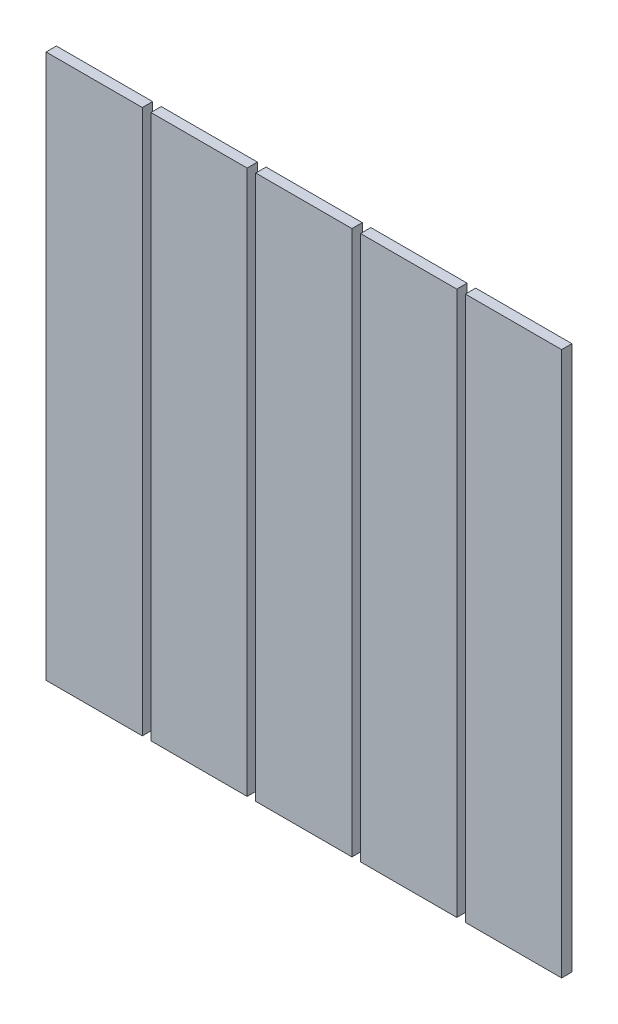
ISO-10303-21;
HEADER;
FILE_DESCRIPTION(('STEP AP214'),'2;1');
FILE_NAME('part.step','',(''),(''),'','','');
FILE_SCHEMA(('AUTOMOTIVE_DESIGN { 1 0 10303 214 1 1 1 1 }'));
ENDSEC;
DATA;
#1=APPLICATION_CONTEXT('core data for automotive mechanical design processes');
#2=APPLICATION_PROTOCOL_DEFINITION('international standard','automotive_design',2000,#1);
#3=PRODUCT_CONTEXT('',#1,'mechanical');
#4=PRODUCT('Part','Part','',(#3));
#5=PRODUCT_RELATED_PRODUCT_CATEGORY('part','',(#4));
#6=PRODUCT_DEFINITION_FORMATION('','',#4);
#7=PRODUCT_DEFINITION_CONTEXT('part definition',#1,'design');
#8=PRODUCT_DEFINITION('design','',#6,#7);
#9=PRODUCT_DEFINITION_SHAPE('','',#8);
#10=(LENGTH_UNIT() NAMED_UNIT(*) SI_UNIT(.MILLI.,.METRE.));
#11=(NAMED_UNIT(*) PLANE_ANGLE_UNIT() SI_UNIT($,.RADIAN.));
#12=(NAMED_UNIT(*) SI_UNIT($,.STERADIAN.) SOLID_ANGLE_UNIT());
#13=UNCERTAINTY_MEASURE_WITH_UNIT(LENGTH_MEASURE(1.E-05),#10,'distance_accuracy_value','');
#14=(GEOMETRIC_REPRESENTATION_CONTEXT(3) GLOBAL_UNCERTAINTY_ASSIGNED_CONTEXT((#13)) GLOBAL_UNIT_ASSIGNED_CONTEXT((#10,
#11,#12)) REPRESENTATION_CONTEXT('',''));
#15=CARTESIAN_POINT('',(0.,0.,0.));
#16=DIRECTION('',(0.,0.,1.));
#17=DIRECTION('',(1.,0.,0.));
#18=AXIS2_PLACEMENT_3D('',#15,#16,#17);
#19=CARTESIAN_POINT('',(-1.11022302462516E-13,950.,18.));
#20=DIRECTION('',(0.,-1.,0.));
#21=DIRECTION('',(1.,0.,0.));
#22=AXIS2_PLACEMENT_3D('',#19,#20,#21);
#23=PLANE('',#22);
#24=DIRECTION('',(-1.,0.,0.));
#25=VECTOR('',#24,1.);
#26=CARTESIAN_POINT('',(-1.11022302462516E-13,950.,18.));
#27=LINE('',#26,#25);
#28=CARTESIAN_POINT('',(-732.,950.,18.));
#29=VERTEX_POINT('',#28);
#30=CARTESIAN_POINT('',(-900.,950.,18.));
#31=VERTEX_POINT('',#30);
#32=EDGE_CURVE('E108',#29,#31,#27,.T.);
#33=ORIENTED_EDGE('',*,*,#32,.F.);
#34=DIRECTION('',(0.,0.,1.));
#35=VECTOR('',#34,1.);
#36=CARTESIAN_POINT('',(-732.,950.,0.));
#37=LINE('',#36,#35);
#38=CARTESIAN_POINT('',(-732.,950.,0.));
#39=VERTEX_POINT('',#38);
#40=EDGE_CURVE('E12',#39,#29,#37,.T.);
#41=ORIENTED_EDGE('',*,*,#40,.F.);
#42=DIRECTION('',(-1.,0.,0.));
#43=VECTOR('',#42,1.);
#44=CARTESIAN_POINT('',(-1.11022302462516E-13,950.,0.));
#45=LINE('',#44,#43);
#46=CARTESIAN_POINT('',(-900.,950.,0.));
#47=VERTEX_POINT('',#46);
#48=EDGE_CURVE('E97',#39,#47,#45,.T.);
#49=ORIENTED_EDGE('',*,*,#48,.T.);
#50=DIRECTION('',(0.,0.,-1.));
#51=VECTOR('',#50,1.);
#52=CARTESIAN_POINT('',(-900.,950.,18.));
#53=LINE('',#52,#51);
#54=EDGE_CURVE('E102',#31,#47,#53,.T.);
#55=ORIENTED_EDGE('',*,*,#54,.F.);
#56=EDGE_LOOP('',(#33,#41,#49,#55));
#57=FACE_BOUND('',#56,.T.);
#58=ADVANCED_FACE('F47',(#57),#23,.F.);
#59=CARTESIAN_POINT('',(-900.,-1.13892152320704E-13,18.));
#60=DIRECTION('',(1.,0.,0.));
#61=DIRECTION('',(0.,1.,0.));
#62=AXIS2_PLACEMENT_3D('',#59,#60,#61);
#63=PLANE('',#62);
#64=DIRECTION('',(0.,-1.,0.));
#65=VECTOR('',#64,1.);
#66=CARTESIAN_POINT('',(-900.,-1.13892152320704E-13,0.));
#67=LINE('',#66,#65);
#68=CARTESIAN_POINT('',(-900.,-1.13892152320704E-13,0.));
#69=VERTEX_POINT('',#68);
#70=EDGE_CURVE('E105',#47,#69,#67,.T.);
#71=ORIENTED_EDGE('',*,*,#70,.T.);
#72=DIRECTION('',(0.,0.,-1.));
#73=VECTOR('',#72,1.);
#74=CARTESIAN_POINT('',(-900.,-1.13892152320704E-13,18.));
#75=LINE('',#74,#73);
#76=CARTESIAN_POINT('',(-900.,-1.13892152320704E-13,18.));
#77=VERTEX_POINT('',#76);
#78=EDGE_CURVE('E89',#77,#69,#75,.T.);
#79=ORIENTED_EDGE('',*,*,#78,.F.);
#80=DIRECTION('',(0.,-1.,0.));
#81=VECTOR('',#80,1.);
#82=CARTESIAN_POINT('',(-900.,-1.13892152320704E-13,18.));
#83=LINE('',#82,#81);
#84=EDGE_CURVE('E109',#31,#77,#83,.T.);
#85=ORIENTED_EDGE('',*,*,#84,.F.);
#86=ORIENTED_EDGE('',*,*,#54,.T.);
#87=EDGE_LOOP('',(#71,#79,#85,#86));
#88=FACE_BOUND('',#87,.T.);
#89=ADVANCED_FACE('F120',(#88),#63,.F.);
#90=CARTESIAN_POINT('',(0.,0.,18.));
#91=DIRECTION('',(0.,1.,0.));
#92=DIRECTION('',(-1.,0.,0.));
#93=AXIS2_PLACEMENT_3D('',#90,#91,#92);
#94=PLANE('',#93);
#95=DIRECTION('',(1.,0.,0.));
#96=VECTOR('',#95,1.);
#97=CARTESIAN_POINT('',(0.,0.,0.));
#98=LINE('',#97,#96);
#99=CARTESIAN_POINT('',(-732.,0.,0.));
#100=VERTEX_POINT('',#99);
#101=EDGE_CURVE('E90',#69,#100,#98,.T.);
#102=ORIENTED_EDGE('',*,*,#101,.T.);
#103=DIRECTION('',(0.,0.,1.));
#104=VECTOR('',#103,1.);
#105=CARTESIAN_POINT('',(-732.,-1.13892152320704E-13,0.));
#106=LINE('',#105,#104);
#107=CARTESIAN_POINT('',(-732.,-1.13892152320704E-13,18.));
#108=VERTEX_POINT('',#107);
#109=EDGE_CURVE('E81',#100,#108,#106,.T.);
#110=ORIENTED_EDGE('',*,*,#109,.T.);
#111=DIRECTION('',(1.,0.,0.));
#112=VECTOR('',#111,1.);
#113=CARTESIAN_POINT('',(0.,0.,18.));
#114=LINE('',#113,#112);
#115=EDGE_CURVE('E50',#77,#108,#114,.T.);
#116=ORIENTED_EDGE('',*,*,#115,.F.);
#117=ORIENTED_EDGE('',*,*,#78,.T.);
#118=EDGE_LOOP('',(#102,#110,#116,#117));
#119=FACE_BOUND('',#118,.T.);
#120=ADVANCED_FACE('F100',(#119),#94,.F.);
#121=CARTESIAN_POINT('',(0.,0.,18.));
#122=DIRECTION('',(0.,0.,1.));
#123=DIRECTION('',(1.,0.,0.));
#124=AXIS2_PLACEMENT_3D('',#121,#122,#123);
#125=PLANE('',#124);
#126=DIRECTION('',(0.,-1.,0.));
#127=VECTOR('',#126,1.);
#128=CARTESIAN_POINT('',(-732.,950.,18.));
#129=LINE('',#128,#127);
#130=EDGE_CURVE('E56',#29,#108,#129,.T.);
#131=ORIENTED_EDGE('',*,*,#130,.F.);
#132=ORIENTED_EDGE('',*,*,#32,.T.);
#133=ORIENTED_EDGE('',*,*,#84,.T.);
#134=ORIENTED_EDGE('',*,*,#115,.T.);
#135=EDGE_LOOP('',(#131,#132,#133,#134));
#136=FACE_BOUND('',#135,.T.);
#137=ADVANCED_FACE('F121',(#136),#125,.T.);
#138=CARTESIAN_POINT('',(0.,0.,0.));
#139=DIRECTION('',(0.,0.,1.));
#140=DIRECTION('',(1.,0.,0.));
#141=AXIS2_PLACEMENT_3D('',#138,#139,#140);
#142=PLANE('',#141);
#143=ORIENTED_EDGE('',*,*,#48,.F.);
#144=DIRECTION('',(0.,-1.,0.));
#145=VECTOR('',#144,1.);
#146=CARTESIAN_POINT('',(-732.,950.,0.));
#147=LINE('',#146,#145);
#148=EDGE_CURVE('E84',#39,#100,#147,.T.);
#149=ORIENTED_EDGE('',*,*,#148,.T.);
#150=ORIENTED_EDGE('',*,*,#101,.F.);
#151=ORIENTED_EDGE('',*,*,#70,.F.);
#152=EDGE_LOOP('',(#143,#149,#150,#151));
#153=FACE_BOUND('',#152,.T.);
#154=ADVANCED_FACE('F95',(#153),#142,.F.);
#155=CARTESIAN_POINT('',(-732.,950.,0.));
#156=DIRECTION('',(-1.,0.,0.));
#157=DIRECTION('',(0.,-1.,0.));
#158=AXIS2_PLACEMENT_3D('',#155,#156,#157);
#159=PLANE('',#158);
#160=ORIENTED_EDGE('',*,*,#130,.T.);
#161=ORIENTED_EDGE('',*,*,#109,.F.);
#162=ORIENTED_EDGE('',*,*,#148,.F.);
#163=ORIENTED_EDGE('',*,*,#40,.T.);
#164=EDGE_LOOP('',(#160,#161,#162,#163));
#165=FACE_BOUND('',#164,.T.);
#166=ADVANCED_FACE('F83',(#165),#159,.F.);
#167=CLOSED_SHELL('',(#58,#89,#120,#137,#154,#166));
#168=MANIFOLD_SOLID_BREP('B2',#167);
#169=CARTESIAN_POINT('',(0.,0.,0.));
#170=DIRECTION('',(0.,0.,1.));
#171=DIRECTION('',(1.,0.,0.));
#172=AXIS2_PLACEMENT_3D('',#169,#170,#171);
#173=PLANE('',#172);
#174=DIRECTION('',(1.,0.,0.));
#175=VECTOR('',#174,1.);
#176=CARTESIAN_POINT('',(0.,0.,0.));
#177=LINE('',#176,#175);
#178=CARTESIAN_POINT('',(-717.,-1.13892152320704E-13,0.));
#179=VERTEX_POINT('',#178);
#180=CARTESIAN_POINT('',(-549.,0.,0.));
#181=VERTEX_POINT('',#180);
#182=EDGE_CURVE('E231',#179,#181,#177,.T.);
#183=ORIENTED_EDGE('',*,*,#182,.F.);
#184=DIRECTION('',(0.,1.,0.));
#185=VECTOR('',#184,1.);
#186=CARTESIAN_POINT('',(-717.,950.,0.));
#187=LINE('',#186,#185);
#188=CARTESIAN_POINT('',(-717.,950.,0.));
#189=VERTEX_POINT('',#188);
#190=EDGE_CURVE('E218',#179,#189,#187,.T.);
#191=ORIENTED_EDGE('',*,*,#190,.T.);
#192=DIRECTION('',(-1.,0.,0.));
#193=VECTOR('',#192,1.);
#194=CARTESIAN_POINT('',(-1.11022302462516E-13,950.,0.));
#195=LINE('',#194,#193);
#196=CARTESIAN_POINT('',(-549.,950.,0.));
#197=VERTEX_POINT('',#196);
#198=EDGE_CURVE('E224',#197,#189,#195,.T.);
#199=ORIENTED_EDGE('',*,*,#198,.F.);
#200=DIRECTION('',(0.,-1.,0.));
#201=VECTOR('',#200,1.);
#202=CARTESIAN_POINT('',(-549.,950.,0.));
#203=LINE('',#202,#201);
#204=EDGE_CURVE('E232',#197,#181,#203,.T.);
#205=ORIENTED_EDGE('',*,*,#204,.T.);
#206=EDGE_LOOP('',(#183,#191,#199,#205));
#207=FACE_BOUND('',#206,.T.);
#208=ADVANCED_FACE('F180',(#207),#173,.F.);
#209=CARTESIAN_POINT('',(0.,0.,18.));
#210=DIRECTION('',(0.,0.,1.));
#211=DIRECTION('',(1.,0.,0.));
#212=AXIS2_PLACEMENT_3D('',#209,#210,#211);
#213=PLANE('',#212);
#214=DIRECTION('',(0.,1.,0.));
#215=VECTOR('',#214,1.);
#216=CARTESIAN_POINT('',(-717.,950.,18.));
#217=LINE('',#216,#215);
#218=CARTESIAN_POINT('',(-717.,-1.13892152320704E-13,18.));
#219=VERTEX_POINT('',#218);
#220=CARTESIAN_POINT('',(-717.,950.,18.));
#221=VERTEX_POINT('',#220);
#222=EDGE_CURVE('E190',#219,#221,#217,.T.);
#223=ORIENTED_EDGE('',*,*,#222,.F.);
#224=DIRECTION('',(1.,0.,0.));
#225=VECTOR('',#224,1.);
#226=CARTESIAN_POINT('',(0.,0.,18.));
#227=LINE('',#226,#225);
#228=CARTESIAN_POINT('',(-549.,-1.13892152320704E-13,18.));
#229=VERTEX_POINT('',#228);
#230=EDGE_CURVE('E184',#219,#229,#227,.T.);
#231=ORIENTED_EDGE('',*,*,#230,.T.);
#232=DIRECTION('',(0.,-1.,0.));
#233=VECTOR('',#232,1.);
#234=CARTESIAN_POINT('',(-549.,950.,18.));
#235=LINE('',#234,#233);
#236=CARTESIAN_POINT('',(-549.,950.,18.));
#237=VERTEX_POINT('',#236);
#238=EDGE_CURVE('E223',#237,#229,#235,.T.);
#239=ORIENTED_EDGE('',*,*,#238,.F.);
#240=DIRECTION('',(-1.,0.,0.));
#241=VECTOR('',#240,1.);
#242=CARTESIAN_POINT('',(-1.11022302462516E-13,950.,18.));
#243=LINE('',#242,#241);
#244=EDGE_CURVE('E242',#237,#221,#243,.T.);
#245=ORIENTED_EDGE('',*,*,#244,.T.);
#246=EDGE_LOOP('',(#223,#231,#239,#245));
#247=FACE_BOUND('',#246,.T.);
#248=ADVANCED_FACE('F255',(#247),#213,.T.);
#249=CARTESIAN_POINT('',(0.,0.,18.));
#250=DIRECTION('',(0.,1.,0.));
#251=DIRECTION('',(-1.,0.,0.));
#252=AXIS2_PLACEMENT_3D('',#249,#250,#251);
#253=PLANE('',#252);
#254=ORIENTED_EDGE('',*,*,#230,.F.);
#255=DIRECTION('',(0.,0.,1.));
#256=VECTOR('',#255,1.);
#257=CARTESIAN_POINT('',(-717.,-1.13892152320704E-13,0.));
#258=LINE('',#257,#256);
#259=EDGE_CURVE('E45',#179,#219,#258,.T.);
#260=ORIENTED_EDGE('',*,*,#259,.F.);
#261=ORIENTED_EDGE('',*,*,#182,.T.);
#262=DIRECTION('',(0.,0.,1.));
#263=VECTOR('',#262,1.);
#264=CARTESIAN_POINT('',(-549.,-1.13892152320704E-13,0.));
#265=LINE('',#264,#263);
#266=EDGE_CURVE('E236',#181,#229,#265,.T.);
#267=ORIENTED_EDGE('',*,*,#266,.T.);
#268=EDGE_LOOP('',(#254,#260,#261,#267));
#269=FACE_BOUND('',#268,.T.);
#270=ADVANCED_FACE('F253',(#269),#253,.F.);
#271=CARTESIAN_POINT('',(-1.11022302462516E-13,950.,18.));
#272=DIRECTION('',(0.,-1.,0.));
#273=DIRECTION('',(1.,0.,0.));
#274=AXIS2_PLACEMENT_3D('',#271,#272,#273);
#275=PLANE('',#274);
#276=ORIENTED_EDGE('',*,*,#198,.T.);
#277=DIRECTION('',(0.,0.,1.));
#278=VECTOR('',#277,1.);
#279=CARTESIAN_POINT('',(-717.,950.,0.));
#280=LINE('',#279,#278);
#281=EDGE_CURVE('E215',#189,#221,#280,.T.);
#282=ORIENTED_EDGE('',*,*,#281,.T.);
#283=ORIENTED_EDGE('',*,*,#244,.F.);
#284=DIRECTION('',(0.,0.,1.));
#285=VECTOR('',#284,1.);
#286=CARTESIAN_POINT('',(-549.,950.,0.));
#287=LINE('',#286,#285);
#288=EDGE_CURVE('E235',#197,#237,#287,.T.);
#289=ORIENTED_EDGE('',*,*,#288,.F.);
#290=EDGE_LOOP('',(#276,#282,#283,#289));
#291=FACE_BOUND('',#290,.T.);
#292=ADVANCED_FACE('F182',(#291),#275,.F.);
#293=CARTESIAN_POINT('',(-549.,950.,0.));
#294=DIRECTION('',(-1.,0.,0.));
#295=DIRECTION('',(0.,-1.,0.));
#296=AXIS2_PLACEMENT_3D('',#293,#294,#295);
#297=PLANE('',#296);
#298=ORIENTED_EDGE('',*,*,#238,.T.);
#299=ORIENTED_EDGE('',*,*,#266,.F.);
#300=ORIENTED_EDGE('',*,*,#204,.F.);
#301=ORIENTED_EDGE('',*,*,#288,.T.);
#302=EDGE_LOOP('',(#298,#299,#300,#301));
#303=FACE_BOUND('',#302,.T.);
#304=ADVANCED_FACE('F251',(#303),#297,.F.);
#305=CARTESIAN_POINT('',(-717.,950.,0.));
#306=DIRECTION('',(1.,0.,0.));
#307=DIRECTION('',(0.,1.,0.));
#308=AXIS2_PLACEMENT_3D('',#305,#306,#307);
#309=PLANE('',#308);
#310=ORIENTED_EDGE('',*,*,#222,.T.);
#311=ORIENTED_EDGE('',*,*,#281,.F.);
#312=ORIENTED_EDGE('',*,*,#190,.F.);
#313=ORIENTED_EDGE('',*,*,#259,.T.);
#314=EDGE_LOOP('',(#310,#311,#312,#313));
#315=FACE_BOUND('',#314,.T.);
#316=ADVANCED_FACE('F217',(#315),#309,.F.);
#317=CLOSED_SHELL('',(#208,#248,#270,#292,#304,#316));
#318=MANIFOLD_SOLID_BREP('B6',#317);
#319=CARTESIAN_POINT('',(0.,0.,18.));
#320=DIRECTION('',(0.,0.,1.));
#321=DIRECTION('',(1.,0.,0.));
#322=AXIS2_PLACEMENT_3D('',#319,#320,#321);
#323=PLANE('',#322);
#324=DIRECTION('',(0.,-1.,0.));
#325=VECTOR('',#324,1.);
#326=CARTESIAN_POINT('',(-366.,950.,18.));
#327=LINE('',#326,#325);
#328=CARTESIAN_POINT('',(-366.,950.,18.));
#329=VERTEX_POINT('',#328);
#330=CARTESIAN_POINT('',(-366.,-1.13892152320704E-13,18.));
#331=VERTEX_POINT('',#330);
#332=EDGE_CURVE('E323',#329,#331,#327,.T.);
#333=ORIENTED_EDGE('',*,*,#332,.F.);
#334=DIRECTION('',(-1.,0.,0.));
#335=VECTOR('',#334,1.);
#336=CARTESIAN_POINT('',(-1.11022302462516E-13,950.,18.));
#337=LINE('',#336,#335);
#338=CARTESIAN_POINT('',(-534.,950.,18.));
#339=VERTEX_POINT('',#338);
#340=EDGE_CURVE('E317',#329,#339,#337,.T.);
#341=ORIENTED_EDGE('',*,*,#340,.T.);
#342=DIRECTION('',(0.,1.,0.));
#343=VECTOR('',#342,1.);
#344=CARTESIAN_POINT('',(-534.,-1.13892152320704E-13,18.));
#345=LINE('',#344,#343);
#346=CARTESIAN_POINT('',(-534.,-1.13892152320704E-13,18.));
#347=VERTEX_POINT('',#346);
#348=EDGE_CURVE('E355',#347,#339,#345,.T.);
#349=ORIENTED_EDGE('',*,*,#348,.F.);
#350=DIRECTION('',(1.,0.,0.));
#351=VECTOR('',#350,1.);
#352=CARTESIAN_POINT('',(0.,0.,18.));
#353=LINE('',#352,#351);
#354=EDGE_CURVE('E378',#347,#331,#353,.T.);
#355=ORIENTED_EDGE('',*,*,#354,.T.);
#356=EDGE_LOOP('',(#333,#341,#349,#355));
#357=FACE_BOUND('',#356,.T.);
#358=ADVANCED_FACE('F313',(#357),#323,.T.);
#359=CARTESIAN_POINT('',(0.,0.,0.));
#360=DIRECTION('',(0.,0.,1.));
#361=DIRECTION('',(1.,0.,0.));
#362=AXIS2_PLACEMENT_3D('',#359,#360,#361);
#363=PLANE('',#362);
#364=DIRECTION('',(-1.,0.,0.));
#365=VECTOR('',#364,1.);
#366=CARTESIAN_POINT('',(-1.11022302462516E-13,950.,0.));
#367=LINE('',#366,#365);
#368=CARTESIAN_POINT('',(-366.,950.,0.));
#369=VERTEX_POINT('',#368);
#370=CARTESIAN_POINT('',(-534.,950.,0.));
#371=VERTEX_POINT('',#370);
#372=EDGE_CURVE('E360',#369,#371,#367,.T.);
#373=ORIENTED_EDGE('',*,*,#372,.F.);
#374=DIRECTION('',(0.,-1.,0.));
#375=VECTOR('',#374,1.);
#376=CARTESIAN_POINT('',(-366.,950.,0.));
#377=LINE('',#376,#375);
#378=CARTESIAN_POINT('',(-366.,0.,0.));
#379=VERTEX_POINT('',#378);
#380=EDGE_CURVE('E369',#369,#379,#377,.T.);
#381=ORIENTED_EDGE('',*,*,#380,.T.);
#382=DIRECTION('',(1.,0.,0.));
#383=VECTOR('',#382,1.);
#384=CARTESIAN_POINT('',(0.,0.,0.));
#385=LINE('',#384,#383);
#386=CARTESIAN_POINT('',(-534.,-1.13892152320704E-13,0.));
#387=VERTEX_POINT('',#386);
#388=EDGE_CURVE('E368',#387,#379,#385,.T.);
#389=ORIENTED_EDGE('',*,*,#388,.F.);
#390=DIRECTION('',(0.,1.,0.));
#391=VECTOR('',#390,1.);
#392=CARTESIAN_POINT('',(-534.,-1.13892152320704E-13,0.));
#393=LINE('',#392,#391);
#394=EDGE_CURVE('E352',#387,#371,#393,.T.);
#395=ORIENTED_EDGE('',*,*,#394,.T.);
#396=EDGE_LOOP('',(#373,#381,#389,#395));
#397=FACE_BOUND('',#396,.T.);
#398=ADVANCED_FACE('F365',(#397),#363,.F.);
#399=CARTESIAN_POINT('',(0.,0.,18.));
#400=DIRECTION('',(0.,1.,0.));
#401=DIRECTION('',(-1.,0.,0.));
#402=AXIS2_PLACEMENT_3D('',#399,#400,#401);
#403=PLANE('',#402);
#404=ORIENTED_EDGE('',*,*,#388,.T.);
#405=DIRECTION('',(0.,0.,1.));
#406=VECTOR('',#405,1.);
#407=CARTESIAN_POINT('',(-366.,-1.13892152320704E-13,0.));
#408=LINE('',#407,#406);
#409=EDGE_CURVE('E371',#379,#331,#408,.T.);
#410=ORIENTED_EDGE('',*,*,#409,.T.);
#411=ORIENTED_EDGE('',*,*,#354,.F.);
#412=DIRECTION('',(0.,0.,1.));
#413=VECTOR('',#412,1.);
#414=CARTESIAN_POINT('',(-534.,-1.13892152320704E-13,0.));
#415=LINE('',#414,#413);
#416=EDGE_CURVE('E382',#387,#347,#415,.T.);
#417=ORIENTED_EDGE('',*,*,#416,.F.);
#418=EDGE_LOOP('',(#404,#410,#411,#417));
#419=FACE_BOUND('',#418,.T.);
#420=ADVANCED_FACE('F386',(#419),#403,.F.);
#421=CARTESIAN_POINT('',(-1.11022302462516E-13,950.,18.));
#422=DIRECTION('',(0.,-1.,0.));
#423=DIRECTION('',(1.,0.,0.));
#424=AXIS2_PLACEMENT_3D('',#421,#422,#423);
#425=PLANE('',#424);
#426=ORIENTED_EDGE('',*,*,#340,.F.);
#427=DIRECTION('',(0.,0.,1.));
#428=VECTOR('',#427,1.);
#429=CARTESIAN_POINT('',(-366.,950.,0.));
#430=LINE('',#429,#428);
#431=EDGE_CURVE('E178',#369,#329,#430,.T.);
#432=ORIENTED_EDGE('',*,*,#431,.F.);
#433=ORIENTED_EDGE('',*,*,#372,.T.);
#434=DIRECTION('',(0.,0.,1.));
#435=VECTOR('',#434,1.);
#436=CARTESIAN_POINT('',(-534.,950.,0.));
#437=LINE('',#436,#435);
#438=EDGE_CURVE('E349',#371,#339,#437,.T.);
#439=ORIENTED_EDGE('',*,*,#438,.T.);
#440=EDGE_LOOP('',(#426,#432,#433,#439));
#441=FACE_BOUND('',#440,.T.);
#442=ADVANCED_FACE('F315',(#441),#425,.F.);
#443=CARTESIAN_POINT('',(-534.,-1.13892152320704E-13,0.));
#444=DIRECTION('',(1.,0.,0.));
#445=DIRECTION('',(0.,0.,-1.));
#446=AXIS2_PLACEMENT_3D('',#443,#444,#445);
#447=PLANE('',#446);
#448=ORIENTED_EDGE('',*,*,#348,.T.);
#449=ORIENTED_EDGE('',*,*,#438,.F.);
#450=ORIENTED_EDGE('',*,*,#394,.F.);
#451=ORIENTED_EDGE('',*,*,#416,.T.);
#452=EDGE_LOOP('',(#448,#449,#450,#451));
#453=FACE_BOUND('',#452,.T.);
#454=ADVANCED_FACE('F351',(#453),#447,.F.);
#455=CARTESIAN_POINT('',(-366.,950.,0.));
#456=DIRECTION('',(-1.,0.,0.));
#457=DIRECTION('',(0.,-1.,0.));
#458=AXIS2_PLACEMENT_3D('',#455,#456,#457);
#459=PLANE('',#458);
#460=ORIENTED_EDGE('',*,*,#332,.T.);
#461=ORIENTED_EDGE('',*,*,#409,.F.);
#462=ORIENTED_EDGE('',*,*,#380,.F.);
#463=ORIENTED_EDGE('',*,*,#431,.T.);
#464=EDGE_LOOP('',(#460,#461,#462,#463));
#465=FACE_BOUND('',#464,.T.);
#466=ADVANCED_FACE('F387',(#465),#459,.F.);
#467=CLOSED_SHELL('',(#358,#398,#420,#442,#454,#466));
#468=MANIFOLD_SOLID_BREP('B39',#467);
#469=CARTESIAN_POINT('',(0.,0.,18.));
#470=DIRECTION('',(0.,0.,1.));
#471=DIRECTION('',(1.,0.,0.));
#472=AXIS2_PLACEMENT_3D('',#469,#470,#471);
#473=PLANE('',#472);
#474=DIRECTION('',(0.,-1.,0.));
#475=VECTOR('',#474,1.);
#476=CARTESIAN_POINT('',(-183.,950.,18.));
#477=LINE('',#476,#475);
#478=CARTESIAN_POINT('',(-183.,950.,18.));
#479=VERTEX_POINT('',#478);
#480=CARTESIAN_POINT('',(-182.999999999999,-1.13892152320704E-13,18.));
#481=VERTEX_POINT('',#480);
#482=EDGE_CURVE('E455',#479,#481,#477,.T.);
#483=ORIENTED_EDGE('',*,*,#482,.F.);
#484=DIRECTION('',(-1.,0.,0.));
#485=VECTOR('',#484,1.);
#486=CARTESIAN_POINT('',(-1.11022302462516E-13,950.,18.));
#487=LINE('',#486,#485);
#488=CARTESIAN_POINT('',(-351.,950.,18.));
#489=VERTEX_POINT('',#488);
#490=EDGE_CURVE('E449',#479,#489,#487,.T.);
#491=ORIENTED_EDGE('',*,*,#490,.T.);
#492=DIRECTION('',(0.,1.,0.));
#493=VECTOR('',#492,1.);
#494=CARTESIAN_POINT('',(-351.,950.,18.));
#495=LINE('',#494,#493);
#496=CARTESIAN_POINT('',(-351.,-1.13892152320704E-13,18.));
#497=VERTEX_POINT('',#496);
#498=EDGE_CURVE('E487',#497,#489,#495,.T.);
#499=ORIENTED_EDGE('',*,*,#498,.F.);
#500=DIRECTION('',(1.,0.,0.));
#501=VECTOR('',#500,1.);
#502=CARTESIAN_POINT('',(0.,0.,18.));
#503=LINE('',#502,#501);
#504=EDGE_CURVE('E510',#497,#481,#503,.T.);
#505=ORIENTED_EDGE('',*,*,#504,.T.);
#506=EDGE_LOOP('',(#483,#491,#499,#505));
#507=FACE_BOUND('',#506,.T.);
#508=ADVANCED_FACE('F445',(#507),#473,.T.);
#509=CARTESIAN_POINT('',(0.,0.,0.));
#510=DIRECTION('',(0.,0.,1.));
#511=DIRECTION('',(1.,0.,0.));
#512=AXIS2_PLACEMENT_3D('',#509,#510,#511);
#513=PLANE('',#512);
#514=DIRECTION('',(-1.,0.,0.));
#515=VECTOR('',#514,1.);
#516=CARTESIAN_POINT('',(-1.11022302462516E-13,950.,0.));
#517=LINE('',#516,#515);
#518=CARTESIAN_POINT('',(-183.,950.,0.));
#519=VERTEX_POINT('',#518);
#520=CARTESIAN_POINT('',(-351.,950.,0.));
#521=VERTEX_POINT('',#520);
#522=EDGE_CURVE('E492',#519,#521,#517,.T.);
#523=ORIENTED_EDGE('',*,*,#522,.F.);
#524=DIRECTION('',(0.,-1.,0.));
#525=VECTOR('',#524,1.);
#526=CARTESIAN_POINT('',(-183.,950.,0.));
#527=LINE('',#526,#525);
#528=CARTESIAN_POINT('',(-183.,0.,0.));
#529=VERTEX_POINT('',#528);
#530=EDGE_CURVE('E501',#519,#529,#527,.T.);
#531=ORIENTED_EDGE('',*,*,#530,.T.);
#532=DIRECTION('',(1.,0.,0.));
#533=VECTOR('',#532,1.);
#534=CARTESIAN_POINT('',(0.,0.,0.));
#535=LINE('',#534,#533);
#536=CARTESIAN_POINT('',(-351.,-1.13892152320704E-13,0.));
#537=VERTEX_POINT('',#536);
#538=EDGE_CURVE('E500',#537,#529,#535,.T.);
#539=ORIENTED_EDGE('',*,*,#538,.F.);
#540=DIRECTION('',(0.,1.,0.));
#541=VECTOR('',#540,1.);
#542=CARTESIAN_POINT('',(-351.,950.,0.));
#543=LINE('',#542,#541);
#544=EDGE_CURVE('E484',#537,#521,#543,.T.);
#545=ORIENTED_EDGE('',*,*,#544,.T.);
#546=EDGE_LOOP('',(#523,#531,#539,#545));
#547=FACE_BOUND('',#546,.T.);
#548=ADVANCED_FACE('F497',(#547),#513,.F.);
#549=CARTESIAN_POINT('',(0.,0.,18.));
#550=DIRECTION('',(0.,1.,0.));
#551=DIRECTION('',(-1.,0.,0.));
#552=AXIS2_PLACEMENT_3D('',#549,#550,#551);
#553=PLANE('',#552);
#554=ORIENTED_EDGE('',*,*,#538,.T.);
#555=DIRECTION('',(0.,0.,1.));
#556=VECTOR('',#555,1.);
#557=CARTESIAN_POINT('',(-182.999999999999,-1.13892152320704E-13,0.));
#558=LINE('',#557,#556);
#559=EDGE_CURVE('E503',#529,#481,#558,.T.);
#560=ORIENTED_EDGE('',*,*,#559,.T.);
#561=ORIENTED_EDGE('',*,*,#504,.F.);
#562=DIRECTION('',(0.,0.,1.));
#563=VECTOR('',#562,1.);
#564=CARTESIAN_POINT('',(-351.,-1.13892152320704E-13,0.));
#565=LINE('',#564,#563);
#566=EDGE_CURVE('E514',#537,#497,#565,.T.);
#567=ORIENTED_EDGE('',*,*,#566,.F.);
#568=EDGE_LOOP('',(#554,#560,#561,#567));
#569=FACE_BOUND('',#568,.T.);
#570=ADVANCED_FACE('F518',(#569),#553,.F.);
#571=CARTESIAN_POINT('',(-1.11022302462516E-13,950.,18.));
#572=DIRECTION('',(0.,-1.,0.));
#573=DIRECTION('',(1.,0.,0.));
#574=AXIS2_PLACEMENT_3D('',#571,#572,#573);
#575=PLANE('',#574);
#576=ORIENTED_EDGE('',*,*,#490,.F.);
#577=DIRECTION('',(0.,0.,1.));
#578=VECTOR('',#577,1.);
#579=CARTESIAN_POINT('',(-183.,950.,0.));
#580=LINE('',#579,#578);
#581=EDGE_CURVE('E311',#519,#479,#580,.T.);
#582=ORIENTED_EDGE('',*,*,#581,.F.);
#583=ORIENTED_EDGE('',*,*,#522,.T.);
#584=DIRECTION('',(0.,0.,1.));
#585=VECTOR('',#584,1.);
#586=CARTESIAN_POINT('',(-351.,950.,0.));
#587=LINE('',#586,#585);
#588=EDGE_CURVE('E481',#521,#489,#587,.T.);
#589=ORIENTED_EDGE('',*,*,#588,.T.);
#590=EDGE_LOOP('',(#576,#582,#583,#589));
#591=FACE_BOUND('',#590,.T.);
#592=ADVANCED_FACE('F447',(#591),#575,.F.);
#593=CARTESIAN_POINT('',(-351.,950.,0.));
#594=DIRECTION('',(1.,0.,0.));
#595=DIRECTION('',(0.,1.,0.));
#596=AXIS2_PLACEMENT_3D('',#593,#594,#595);
#597=PLANE('',#596);
#598=ORIENTED_EDGE('',*,*,#498,.T.);
#599=ORIENTED_EDGE('',*,*,#588,.F.);
#600=ORIENTED_EDGE('',*,*,#544,.F.);
#601=ORIENTED_EDGE('',*,*,#566,.T.);
#602=EDGE_LOOP('',(#598,#599,#600,#601));
#603=FACE_BOUND('',#602,.T.);
#604=ADVANCED_FACE('F483',(#603),#597,.F.);
#605=CARTESIAN_POINT('',(-183.,950.,0.));
#606=DIRECTION('',(-1.,0.,0.));
#607=DIRECTION('',(0.,-1.,0.));
#608=AXIS2_PLACEMENT_3D('',#605,#606,#607);
#609=PLANE('',#608);
#610=ORIENTED_EDGE('',*,*,#482,.T.);
#611=ORIENTED_EDGE('',*,*,#559,.F.);
#612=ORIENTED_EDGE('',*,*,#530,.F.);
#613=ORIENTED_EDGE('',*,*,#581,.T.);
#614=EDGE_LOOP('',(#610,#611,#612,#613));
#615=FACE_BOUND('',#614,.T.);
#616=ADVANCED_FACE('F519',(#615),#609,.F.);
#617=CLOSED_SHELL('',(#508,#548,#570,#592,#604,#616));
#618=MANIFOLD_SOLID_BREP('B172',#617);
#619=CARTESIAN_POINT('',(0.,0.,18.));
#620=DIRECTION('',(-1.,0.,0.));
#621=DIRECTION('',(0.,-1.,0.));
#622=AXIS2_PLACEMENT_3D('',#619,#620,#621);
#623=PLANE('',#622);
#624=DIRECTION('',(0.,1.,0.));
#625=VECTOR('',#624,1.);
#626=CARTESIAN_POINT('',(0.,0.,0.));
#627=LINE('',#626,#625);
#628=CARTESIAN_POINT('',(0.,0.,0.));
#629=VERTEX_POINT('',#628);
#630=CARTESIAN_POINT('',(-1.11022302462516E-13,950.,0.));
#631=VERTEX_POINT('',#630);
#632=EDGE_CURVE('E619',#629,#631,#627,.T.);
#633=ORIENTED_EDGE('',*,*,#632,.T.);
#634=DIRECTION('',(0.,0.,-1.));
#635=VECTOR('',#634,1.);
#636=CARTESIAN_POINT('',(-1.11022302462516E-13,950.,18.));
#637=LINE('',#636,#635);
#638=CARTESIAN_POINT('',(-1.11022302462516E-13,950.,18.));
#639=VERTEX_POINT('',#638);
#640=EDGE_CURVE('E443',#639,#631,#637,.T.);
#641=ORIENTED_EDGE('',*,*,#640,.F.);
#642=DIRECTION('',(0.,1.,0.));
#643=VECTOR('',#642,1.);
#644=CARTESIAN_POINT('',(0.,0.,18.));
#645=LINE('',#644,#643);
#646=CARTESIAN_POINT('',(0.,0.,18.));
#647=VERTEX_POINT('',#646);
#648=EDGE_CURVE('E613',#647,#639,#645,.T.);
#649=ORIENTED_EDGE('',*,*,#648,.F.);
#650=DIRECTION('',(0.,0.,-1.));
#651=VECTOR('',#650,1.);
#652=CARTESIAN_POINT('',(0.,0.,18.));
#653=LINE('',#652,#651);
#654=EDGE_CURVE('E575',#647,#629,#653,.T.);
#655=ORIENTED_EDGE('',*,*,#654,.T.);
#656=EDGE_LOOP('',(#633,#641,#649,#655));
#657=FACE_BOUND('',#656,.T.);
#658=ADVANCED_FACE('F568',(#657),#623,.F.);
#659=CARTESIAN_POINT('',(0.,0.,0.));
#660=DIRECTION('',(0.,0.,1.));
#661=DIRECTION('',(1.,0.,0.));
#662=AXIS2_PLACEMENT_3D('',#659,#660,#661);
#663=PLANE('',#662);
#664=DIRECTION('',(1.,0.,0.));
#665=VECTOR('',#664,1.);
#666=CARTESIAN_POINT('',(0.,0.,0.));
#667=LINE('',#666,#665);
#668=CARTESIAN_POINT('',(-167.999999999999,-1.13892152320704E-13,0.));
#669=VERTEX_POINT('',#668);
#670=EDGE_CURVE('E605',#669,#629,#667,.T.);
#671=ORIENTED_EDGE('',*,*,#670,.F.);
#672=DIRECTION('',(0.,1.,0.));
#673=VECTOR('',#672,1.);
#674=CARTESIAN_POINT('',(-168.,950.,0.));
#675=LINE('',#674,#673);
#676=CARTESIAN_POINT('',(-168.,950.,0.));
#677=VERTEX_POINT('',#676);
#678=EDGE_CURVE('E631',#669,#677,#675,.T.);
#679=ORIENTED_EDGE('',*,*,#678,.T.);
#680=DIRECTION('',(-1.,0.,0.));
#681=VECTOR('',#680,1.);
#682=CARTESIAN_POINT('',(-1.11022302462516E-13,950.,0.));
#683=LINE('',#682,#681);
#684=EDGE_CURVE('E614',#631,#677,#683,.T.);
#685=ORIENTED_EDGE('',*,*,#684,.F.);
#686=ORIENTED_EDGE('',*,*,#632,.F.);
#687=EDGE_LOOP('',(#671,#679,#685,#686));
#688=FACE_BOUND('',#687,.T.);
#689=ADVANCED_FACE('F620',(#688),#663,.F.);
#690=CARTESIAN_POINT('',(0.,0.,18.));
#691=DIRECTION('',(0.,0.,1.));
#692=DIRECTION('',(1.,0.,0.));
#693=AXIS2_PLACEMENT_3D('',#690,#691,#692);
#694=PLANE('',#693);
#695=DIRECTION('',(0.,1.,0.));
#696=VECTOR('',#695,1.);
#697=CARTESIAN_POINT('',(-168.,950.,18.));
#698=LINE('',#697,#696);
#699=CARTESIAN_POINT('',(-167.999999999999,-1.13892152320704E-13,18.));
#700=VERTEX_POINT('',#699);
#701=CARTESIAN_POINT('',(-168.,950.,18.));
#702=VERTEX_POINT('',#701);
#703=EDGE_CURVE('E633',#700,#702,#698,.T.);
#704=ORIENTED_EDGE('',*,*,#703,.F.);
#705=DIRECTION('',(1.,0.,0.));
#706=VECTOR('',#705,1.);
#707=CARTESIAN_POINT('',(0.,0.,18.));
#708=LINE('',#707,#706);
#709=EDGE_CURVE('E591',#700,#647,#708,.T.);
#710=ORIENTED_EDGE('',*,*,#709,.T.);
#711=ORIENTED_EDGE('',*,*,#648,.T.);
#712=DIRECTION('',(-1.,0.,0.));
#713=VECTOR('',#712,1.);
#714=CARTESIAN_POINT('',(-1.11022302462516E-13,950.,18.));
#715=LINE('',#714,#713);
#716=EDGE_CURVE('E627',#639,#702,#715,.T.);
#717=ORIENTED_EDGE('',*,*,#716,.T.);
#718=EDGE_LOOP('',(#704,#710,#711,#717));
#719=FACE_BOUND('',#718,.T.);
#720=ADVANCED_FACE('F638',(#719),#694,.T.);
#721=CARTESIAN_POINT('',(0.,0.,18.));
#722=DIRECTION('',(0.,1.,0.));
#723=DIRECTION('',(-1.,0.,0.));
#724=AXIS2_PLACEMENT_3D('',#721,#722,#723);
#725=PLANE('',#724);
#726=ORIENTED_EDGE('',*,*,#709,.F.);
#727=DIRECTION('',(0.,0.,1.));
#728=VECTOR('',#727,1.);
#729=CARTESIAN_POINT('',(-167.999999999999,-1.13892152320704E-13,0.));
#730=LINE('',#729,#728);
#731=EDGE_CURVE('E610',#669,#700,#730,.T.);
#732=ORIENTED_EDGE('',*,*,#731,.F.);
#733=ORIENTED_EDGE('',*,*,#670,.T.);
#734=ORIENTED_EDGE('',*,*,#654,.F.);
#735=EDGE_LOOP('',(#726,#732,#733,#734));
#736=FACE_BOUND('',#735,.T.);
#737=ADVANCED_FACE('F607',(#736),#725,.F.);
#738=CARTESIAN_POINT('',(-1.11022302462516E-13,950.,18.));
#739=DIRECTION('',(0.,-1.,0.));
#740=DIRECTION('',(1.,0.,0.));
#741=AXIS2_PLACEMENT_3D('',#738,#739,#740);
#742=PLANE('',#741);
#743=ORIENTED_EDGE('',*,*,#684,.T.);
#744=DIRECTION('',(0.,0.,1.));
#745=VECTOR('',#744,1.);
#746=CARTESIAN_POINT('',(-168.,950.,0.));
#747=LINE('',#746,#745);
#748=EDGE_CURVE('E582',#677,#702,#747,.T.);
#749=ORIENTED_EDGE('',*,*,#748,.T.);
#750=ORIENTED_EDGE('',*,*,#716,.F.);
#751=ORIENTED_EDGE('',*,*,#640,.T.);
#752=EDGE_LOOP('',(#743,#749,#750,#751));
#753=FACE_BOUND('',#752,.T.);
#754=ADVANCED_FACE('F636',(#753),#742,.F.);
#755=CARTESIAN_POINT('',(-168.,950.,0.));
#756=DIRECTION('',(1.,0.,0.));
#757=DIRECTION('',(0.,1.,0.));
#758=AXIS2_PLACEMENT_3D('',#755,#756,#757);
#759=PLANE('',#758);
#760=ORIENTED_EDGE('',*,*,#703,.T.);
#761=ORIENTED_EDGE('',*,*,#748,.F.);
#762=ORIENTED_EDGE('',*,*,#678,.F.);
#763=ORIENTED_EDGE('',*,*,#731,.T.);
#764=EDGE_LOOP('',(#760,#761,#762,#763));
#765=FACE_BOUND('',#764,.T.);
#766=ADVANCED_FACE('F675',(#765),#759,.F.);
#767=CLOSED_SHELL('',(#658,#689,#720,#737,#754,#766));
#768=MANIFOLD_SOLID_BREP('B305',#767);
#769=ADVANCED_BREP_SHAPE_REPRESENTATION('',(#18,#168,#318,#468,#618,#768),#14);
#770=SHAPE_DEFINITION_REPRESENTATION(#9,#769);
ENDSEC;
END-ISO-10303-21;
